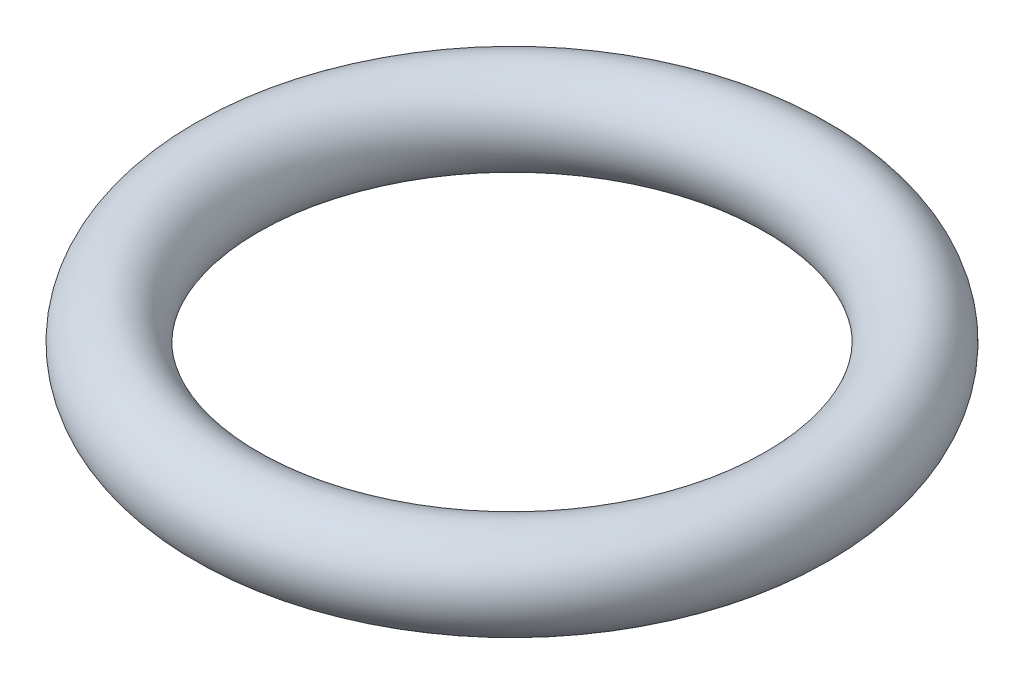
ISO-10303-21;
HEADER;
FILE_DESCRIPTION(('STEP AP214'),'2;1');
FILE_NAME('part.step','',(''),(''),'','','');
FILE_SCHEMA(('AUTOMOTIVE_DESIGN { 1 0 10303 214 1 1 1 1 }'));
ENDSEC;
DATA;
#1=APPLICATION_CONTEXT('core data for automotive mechanical design processes');
#2=APPLICATION_PROTOCOL_DEFINITION('international standard','automotive_design',2000,#1);
#3=PRODUCT_CONTEXT('',#1,'mechanical');
#4=PRODUCT('Part','Part','',(#3));
#5=PRODUCT_RELATED_PRODUCT_CATEGORY('part','',(#4));
#6=PRODUCT_DEFINITION_FORMATION('','',#4);
#7=PRODUCT_DEFINITION_CONTEXT('part definition',#1,'design');
#8=PRODUCT_DEFINITION('design','',#6,#7);
#9=PRODUCT_DEFINITION_SHAPE('','',#8);
#10=(LENGTH_UNIT() NAMED_UNIT(*) SI_UNIT(.MILLI.,.METRE.));
#11=(NAMED_UNIT(*) PLANE_ANGLE_UNIT() SI_UNIT($,.RADIAN.));
#12=(NAMED_UNIT(*) SI_UNIT($,.STERADIAN.) SOLID_ANGLE_UNIT());
#13=UNCERTAINTY_MEASURE_WITH_UNIT(LENGTH_MEASURE(1.E-05),#10,'distance_accuracy_value','');
#14=(GEOMETRIC_REPRESENTATION_CONTEXT(3) GLOBAL_UNCERTAINTY_ASSIGNED_CONTEXT((#13)) GLOBAL_UNIT_ASSIGNED_CONTEXT((#10,
#11,#12)) REPRESENTATION_CONTEXT('',''));
#15=CARTESIAN_POINT('',(0.,0.,0.));
#16=DIRECTION('',(0.,0.,1.));
#17=DIRECTION('',(1.,0.,0.));
#18=AXIS2_PLACEMENT_3D('',#15,#16,#17);
#19=CARTESIAN_POINT('',(0.,0.,0.));
#20=DIRECTION('',(0.,-1.,0.));
#21=DIRECTION('',(1.,0.,0.));
#22=AXIS2_PLACEMENT_3D('',#19,#20,#21);
#23=TOROIDAL_SURFACE('',#22,8.,1.25);
#24=CARTESIAN_POINT('',(9.25,0.,0.));
#25=VERTEX_POINT('',#24);
#26=VERTEX_LOOP('',#25);
#27=FACE_BOUND('',#26,.T.);
#28=ADVANCED_FACE('F29',(#27),#23,.T.);
#29=CLOSED_SHELL('',(#28));
#30=MANIFOLD_SOLID_BREP('B2',#29);
#31=ADVANCED_BREP_SHAPE_REPRESENTATION('',(#18,#30),#14);
#32=SHAPE_DEFINITION_REPRESENTATION(#9,#31);
ENDSEC;
END-ISO-10303-21;
